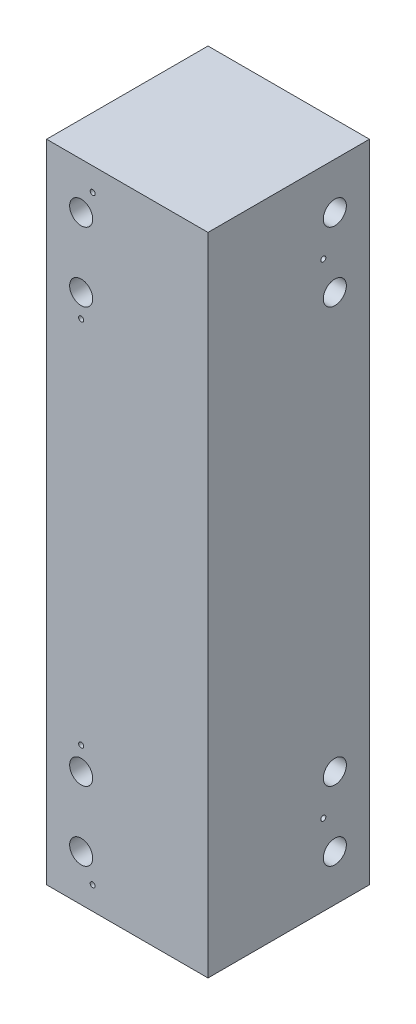
ISO-10303-21;
HEADER;
FILE_DESCRIPTION(('STEP AP214'),'2;1');
FILE_NAME('part.step','',(''),(''),'','','');
FILE_SCHEMA(('AUTOMOTIVE_DESIGN { 1 0 10303 214 1 1 1 1 }'));
ENDSEC;
DATA;
#1=APPLICATION_CONTEXT('core data for automotive mechanical design processes');
#2=APPLICATION_PROTOCOL_DEFINITION('international standard','automotive_design',2000,#1);
#3=PRODUCT_CONTEXT('',#1,'mechanical');
#4=PRODUCT('Part','Part','',(#3));
#5=PRODUCT_RELATED_PRODUCT_CATEGORY('part','',(#4));
#6=PRODUCT_DEFINITION_FORMATION('','',#4);
#7=PRODUCT_DEFINITION_CONTEXT('part definition',#1,'design');
#8=PRODUCT_DEFINITION('design','',#6,#7);
#9=PRODUCT_DEFINITION_SHAPE('','',#8);
#10=(LENGTH_UNIT() NAMED_UNIT(*) SI_UNIT(.MILLI.,.METRE.));
#11=(NAMED_UNIT(*) PLANE_ANGLE_UNIT() SI_UNIT($,.RADIAN.));
#12=(NAMED_UNIT(*) SI_UNIT($,.STERADIAN.) SOLID_ANGLE_UNIT());
#13=UNCERTAINTY_MEASURE_WITH_UNIT(LENGTH_MEASURE(1.E-05),#10,'distance_accuracy_value','');
#14=(GEOMETRIC_REPRESENTATION_CONTEXT(3) GLOBAL_UNCERTAINTY_ASSIGNED_CONTEXT((#13)) GLOBAL_UNIT_ASSIGNED_CONTEXT((#10,
#11,#12)) REPRESENTATION_CONTEXT('',''));
#15=CARTESIAN_POINT('',(0.,0.,0.));
#16=DIRECTION('',(0.,0.,1.));
#17=DIRECTION('',(1.,0.,0.));
#18=AXIS2_PLACEMENT_3D('',#15,#16,#17);
#19=CARTESIAN_POINT('',(0.,355.6,0.));
#20=DIRECTION('',(1.,0.,0.));
#21=DIRECTION('',(0.,0.,-1.));
#22=AXIS2_PLACEMENT_3D('',#19,#20,#21);
#23=PLANE('',#22);
#24=CARTESIAN_POINT('',(0.,311.15,25.4));
#25=DIRECTION('',(-1.,0.,0.));
#26=DIRECTION('',(0.,0.,1.));
#27=AXIS2_PLACEMENT_3D('',#24,#25,#26);
#28=CIRCLE('',#27,1.38906249999996);
#29=CARTESIAN_POINT('',(0.,311.15,26.7890625));
#30=VERTEX_POINT('',#29);
#31=EDGE_CURVE('E227',#30,#30,#28,.T.);
#32=ORIENTED_EDGE('',*,*,#31,.F.);
#33=EDGE_LOOP('',(#32));
#34=FACE_BOUND('',#33,.T.);
#35=CARTESIAN_POINT('',(0.,44.45,25.4));
#36=DIRECTION('',(-1.,0.,0.));
#37=DIRECTION('',(0.,0.,1.));
#38=AXIS2_PLACEMENT_3D('',#35,#36,#37);
#39=CIRCLE('',#38,1.3890625);
#40=CARTESIAN_POINT('',(0.,44.45,26.7890625));
#41=VERTEX_POINT('',#40);
#42=EDGE_CURVE('E231',#41,#41,#39,.T.);
#43=ORIENTED_EDGE('',*,*,#42,.F.);
#44=EDGE_LOOP('',(#43));
#45=FACE_BOUND('',#44,.T.);
#46=DIRECTION('',(0.,0.,1.));
#47=VECTOR('',#46,1.);
#48=CARTESIAN_POINT('',(0.,0.,0.));
#49=LINE('',#48,#47);
#50=CARTESIAN_POINT('',(0.,0.,0.));
#51=VERTEX_POINT('',#50);
#52=CARTESIAN_POINT('',(0.,0.,88.9));
#53=VERTEX_POINT('',#52);
#54=EDGE_CURVE('E298',#51,#53,#49,.T.);
#55=ORIENTED_EDGE('',*,*,#54,.T.);
#56=DIRECTION('',(0.,-1.,0.));
#57=VECTOR('',#56,1.);
#58=CARTESIAN_POINT('',(0.,355.6,88.9));
#59=LINE('',#58,#57);
#60=CARTESIAN_POINT('',(0.,355.6,88.9));
#61=VERTEX_POINT('',#60);
#62=EDGE_CURVE('E12',#61,#53,#59,.T.);
#63=ORIENTED_EDGE('',*,*,#62,.F.);
#64=DIRECTION('',(0.,0.,1.));
#65=VECTOR('',#64,1.);
#66=CARTESIAN_POINT('',(0.,355.6,0.));
#67=LINE('',#66,#65);
#68=CARTESIAN_POINT('',(0.,355.6,0.));
#69=VERTEX_POINT('',#68);
#70=EDGE_CURVE('E297',#69,#61,#67,.T.);
#71=ORIENTED_EDGE('',*,*,#70,.F.);
#72=DIRECTION('',(0.,-1.,0.));
#73=VECTOR('',#72,1.);
#74=CARTESIAN_POINT('',(0.,355.6,0.));
#75=LINE('',#74,#73);
#76=EDGE_CURVE('E282',#69,#51,#75,.T.);
#77=ORIENTED_EDGE('',*,*,#76,.T.);
#78=EDGE_LOOP('',(#55,#63,#71,#77));
#79=FACE_BOUND('',#78,.T.);
#80=ADVANCED_FACE('F56',(#34,#45,#79),#23,.F.);
#81=CARTESIAN_POINT('',(0.,355.6,88.9));
#82=DIRECTION('',(0.,0.,-1.));
#83=DIRECTION('',(-1.,0.,0.));
#84=AXIS2_PLACEMENT_3D('',#81,#82,#83);
#85=PLANE('',#84);
#86=CARTESIAN_POINT('',(19.05,292.1,88.9));
#87=DIRECTION('',(0.,0.,1.));
#88=DIRECTION('',(1.,0.,0.));
#89=AXIS2_PLACEMENT_3D('',#86,#87,#88);
#90=CIRCLE('',#89,6.34999999999999);
#91=CARTESIAN_POINT('',(25.4,292.1,88.9));
#92=VERTEX_POINT('',#91);
#93=EDGE_CURVE('E174',#92,#92,#90,.T.);
#94=ORIENTED_EDGE('',*,*,#93,.F.);
#95=EDGE_LOOP('',(#94));
#96=FACE_BOUND('',#95,.T.);
#97=CARTESIAN_POINT('',(19.05,330.2,88.9));
#98=DIRECTION('',(0.,0.,1.));
#99=DIRECTION('',(1.,0.,0.));
#100=AXIS2_PLACEMENT_3D('',#97,#98,#99);
#101=CIRCLE('',#100,6.34999999999999);
#102=CARTESIAN_POINT('',(25.4,330.2,88.9));
#103=VERTEX_POINT('',#102);
#104=EDGE_CURVE('E180',#103,#103,#101,.T.);
#105=ORIENTED_EDGE('',*,*,#104,.F.);
#106=EDGE_LOOP('',(#105));
#107=FACE_BOUND('',#106,.T.);
#108=CARTESIAN_POINT('',(19.05,25.4,88.9));
#109=DIRECTION('',(0.,0.,1.));
#110=DIRECTION('',(1.,0.,0.));
#111=AXIS2_PLACEMENT_3D('',#108,#109,#110);
#112=CIRCLE('',#111,6.34999999999999);
#113=CARTESIAN_POINT('',(25.4,25.4,88.9));
#114=VERTEX_POINT('',#113);
#115=EDGE_CURVE('E186',#114,#114,#112,.T.);
#116=ORIENTED_EDGE('',*,*,#115,.F.);
#117=EDGE_LOOP('',(#116));
#118=FACE_BOUND('',#117,.T.);
#119=CARTESIAN_POINT('',(19.05,63.5,88.9));
#120=DIRECTION('',(0.,0.,1.));
#121=DIRECTION('',(1.,0.,0.));
#122=AXIS2_PLACEMENT_3D('',#119,#120,#121);
#123=CIRCLE('',#122,6.34999999999999);
#124=CARTESIAN_POINT('',(25.4,63.5,88.9));
#125=VERTEX_POINT('',#124);
#126=EDGE_CURVE('E192',#125,#125,#123,.T.);
#127=ORIENTED_EDGE('',*,*,#126,.F.);
#128=EDGE_LOOP('',(#127));
#129=FACE_BOUND('',#128,.T.);
#130=CARTESIAN_POINT('',(25.4,12.7,88.9));
#131=DIRECTION('',(0.,0.,1.));
#132=DIRECTION('',(1.,0.,0.));
#133=AXIS2_PLACEMENT_3D('',#130,#131,#132);
#134=CIRCLE('',#133,1.3890625);
#135=CARTESIAN_POINT('',(26.7890625,12.7,88.9));
#136=VERTEX_POINT('',#135);
#137=EDGE_CURVE('E256',#136,#136,#134,.T.);
#138=ORIENTED_EDGE('',*,*,#137,.F.);
#139=EDGE_LOOP('',(#138));
#140=FACE_BOUND('',#139,.T.);
#141=CARTESIAN_POINT('',(19.05,76.2,88.9));
#142=DIRECTION('',(0.,0.,1.));
#143=DIRECTION('',(1.,0.,0.));
#144=AXIS2_PLACEMENT_3D('',#141,#142,#143);
#145=CIRCLE('',#144,1.38906250000001);
#146=CARTESIAN_POINT('',(20.4390625,76.2,88.9));
#147=VERTEX_POINT('',#146);
#148=EDGE_CURVE('E273',#147,#147,#145,.T.);
#149=ORIENTED_EDGE('',*,*,#148,.F.);
#150=EDGE_LOOP('',(#149));
#151=FACE_BOUND('',#150,.T.);
#152=CARTESIAN_POINT('',(25.4,342.9,88.9));
#153=DIRECTION('',(0.,0.,1.));
#154=DIRECTION('',(1.,0.,0.));
#155=AXIS2_PLACEMENT_3D('',#152,#153,#154);
#156=CIRCLE('',#155,1.38906249999996);
#157=CARTESIAN_POINT('',(26.7890625,342.9,88.9));
#158=VERTEX_POINT('',#157);
#159=EDGE_CURVE('E311',#158,#158,#156,.T.);
#160=ORIENTED_EDGE('',*,*,#159,.F.);
#161=EDGE_LOOP('',(#160));
#162=FACE_BOUND('',#161,.T.);
#163=CARTESIAN_POINT('',(19.05,279.4,88.9));
#164=DIRECTION('',(0.,0.,1.));
#165=DIRECTION('',(1.,0.,0.));
#166=AXIS2_PLACEMENT_3D('',#163,#164,#165);
#167=CIRCLE('',#166,1.38906249999998);
#168=CARTESIAN_POINT('',(20.4390625,279.4,88.9));
#169=VERTEX_POINT('',#168);
#170=EDGE_CURVE('E318',#169,#169,#167,.T.);
#171=ORIENTED_EDGE('',*,*,#170,.F.);
#172=EDGE_LOOP('',(#171));
#173=FACE_BOUND('',#172,.T.);
#174=DIRECTION('',(1.,0.,0.));
#175=VECTOR('',#174,1.);
#176=CARTESIAN_POINT('',(0.,0.,88.9));
#177=LINE('',#176,#175);
#178=CARTESIAN_POINT('',(88.9,0.,88.9));
#179=VERTEX_POINT('',#178);
#180=EDGE_CURVE('E296',#53,#179,#177,.T.);
#181=ORIENTED_EDGE('',*,*,#180,.T.);
#182=DIRECTION('',(0.,-1.,0.));
#183=VECTOR('',#182,1.);
#184=CARTESIAN_POINT('',(88.9,355.6,88.9));
#185=LINE('',#184,#183);
#186=CARTESIAN_POINT('',(88.9,355.6,88.9));
#187=VERTEX_POINT('',#186);
#188=EDGE_CURVE('E65',#187,#179,#185,.T.);
#189=ORIENTED_EDGE('',*,*,#188,.F.);
#190=DIRECTION('',(1.,0.,0.));
#191=VECTOR('',#190,1.);
#192=CARTESIAN_POINT('',(0.,355.6,88.9));
#193=LINE('',#192,#191);
#194=EDGE_CURVE('E104',#61,#187,#193,.T.);
#195=ORIENTED_EDGE('',*,*,#194,.F.);
#196=ORIENTED_EDGE('',*,*,#62,.T.);
#197=EDGE_LOOP('',(#181,#189,#195,#196));
#198=FACE_BOUND('',#197,.T.);
#199=ADVANCED_FACE('F329',(#96,#107,#118,#129,#140,#151,#162,#173,#198),#85,.F.);
#200=CARTESIAN_POINT('',(88.9,355.6,0.));
#201=DIRECTION('',(-1.,0.,0.));
#202=DIRECTION('',(0.,0.,1.));
#203=AXIS2_PLACEMENT_3D('',#200,#201,#202);
#204=PLANE('',#203);
#205=CARTESIAN_POINT('',(88.9,63.5,19.05));
#206=DIRECTION('',(1.,0.,0.));
#207=DIRECTION('',(0.,0.,-1.));
#208=AXIS2_PLACEMENT_3D('',#205,#206,#207);
#209=CIRCLE('',#208,6.34999999999999);
#210=CARTESIAN_POINT('',(88.9,63.5,12.7));
#211=VERTEX_POINT('',#210);
#212=EDGE_CURVE('E198',#211,#211,#209,.T.);
#213=ORIENTED_EDGE('',*,*,#212,.F.);
#214=EDGE_LOOP('',(#213));
#215=FACE_BOUND('',#214,.T.);
#216=CARTESIAN_POINT('',(88.9,25.4,19.05));
#217=DIRECTION('',(1.,0.,0.));
#218=DIRECTION('',(0.,0.,-1.));
#219=AXIS2_PLACEMENT_3D('',#216,#217,#218);
#220=CIRCLE('',#219,6.34999999999999);
#221=CARTESIAN_POINT('',(88.9,25.4,12.7));
#222=VERTEX_POINT('',#221);
#223=EDGE_CURVE('E204',#222,#222,#220,.T.);
#224=ORIENTED_EDGE('',*,*,#223,.F.);
#225=EDGE_LOOP('',(#224));
#226=FACE_BOUND('',#225,.T.);
#227=CARTESIAN_POINT('',(88.9,330.2,19.05));
#228=DIRECTION('',(1.,0.,0.));
#229=DIRECTION('',(0.,0.,-1.));
#230=AXIS2_PLACEMENT_3D('',#227,#228,#229);
#231=CIRCLE('',#230,6.34999999999997);
#232=CARTESIAN_POINT('',(88.9,330.2,12.7));
#233=VERTEX_POINT('',#232);
#234=EDGE_CURVE('E210',#233,#233,#231,.T.);
#235=ORIENTED_EDGE('',*,*,#234,.F.);
#236=EDGE_LOOP('',(#235));
#237=FACE_BOUND('',#236,.T.);
#238=CARTESIAN_POINT('',(88.9,292.1,19.05));
#239=DIRECTION('',(1.,0.,0.));
#240=DIRECTION('',(0.,0.,-1.));
#241=AXIS2_PLACEMENT_3D('',#238,#239,#240);
#242=CIRCLE('',#241,6.34999999999997);
#243=CARTESIAN_POINT('',(88.9,292.1,12.7));
#244=VERTEX_POINT('',#243);
#245=EDGE_CURVE('E216',#244,#244,#242,.T.);
#246=ORIENTED_EDGE('',*,*,#245,.F.);
#247=EDGE_LOOP('',(#246));
#248=FACE_BOUND('',#247,.T.);
#249=CARTESIAN_POINT('',(88.9,311.15,25.4));
#250=DIRECTION('',(-1.,0.,0.));
#251=DIRECTION('',(0.,0.,1.));
#252=AXIS2_PLACEMENT_3D('',#249,#250,#251);
#253=CIRCLE('',#252,1.38906249999996);
#254=CARTESIAN_POINT('',(88.9,311.15,26.7890625));
#255=VERTEX_POINT('',#254);
#256=EDGE_CURVE('E223',#255,#255,#253,.T.);
#257=ORIENTED_EDGE('',*,*,#256,.T.);
#258=EDGE_LOOP('',(#257));
#259=FACE_BOUND('',#258,.T.);
#260=CARTESIAN_POINT('',(88.9,44.45,25.4));
#261=DIRECTION('',(-1.,0.,0.));
#262=DIRECTION('',(0.,0.,1.));
#263=AXIS2_PLACEMENT_3D('',#260,#261,#262);
#264=CIRCLE('',#263,1.3890625);
#265=CARTESIAN_POINT('',(88.9,44.45,26.7890625));
#266=VERTEX_POINT('',#265);
#267=EDGE_CURVE('E222',#266,#266,#264,.T.);
#268=ORIENTED_EDGE('',*,*,#267,.T.);
#269=EDGE_LOOP('',(#268));
#270=FACE_BOUND('',#269,.T.);
#271=DIRECTION('',(0.,0.,-1.));
#272=VECTOR('',#271,1.);
#273=CARTESIAN_POINT('',(88.9,0.,0.));
#274=LINE('',#273,#272);
#275=CARTESIAN_POINT('',(88.9,0.,0.));
#276=VERTEX_POINT('',#275);
#277=EDGE_CURVE('E91',#179,#276,#274,.T.);
#278=ORIENTED_EDGE('',*,*,#277,.T.);
#279=DIRECTION('',(0.,-1.,0.));
#280=VECTOR('',#279,1.);
#281=CARTESIAN_POINT('',(88.9,355.6,0.));
#282=LINE('',#281,#280);
#283=CARTESIAN_POINT('',(88.9,355.6,0.));
#284=VERTEX_POINT('',#283);
#285=EDGE_CURVE('E286',#284,#276,#282,.T.);
#286=ORIENTED_EDGE('',*,*,#285,.F.);
#287=DIRECTION('',(0.,0.,-1.));
#288=VECTOR('',#287,1.);
#289=CARTESIAN_POINT('',(88.9,355.6,0.));
#290=LINE('',#289,#288);
#291=EDGE_CURVE('E292',#187,#284,#290,.T.);
#292=ORIENTED_EDGE('',*,*,#291,.F.);
#293=ORIENTED_EDGE('',*,*,#188,.T.);
#294=EDGE_LOOP('',(#278,#286,#292,#293));
#295=FACE_BOUND('',#294,.T.);
#296=ADVANCED_FACE('F291',(#215,#226,#237,#248,#259,#270,#295),#204,.F.);
#297=CARTESIAN_POINT('',(0.,355.6,0.));
#298=DIRECTION('',(0.,0.,1.));
#299=DIRECTION('',(1.,0.,0.));
#300=AXIS2_PLACEMENT_3D('',#297,#298,#299);
#301=PLANE('',#300);
#302=CARTESIAN_POINT('',(25.4,12.7,0.));
#303=DIRECTION('',(0.,0.,1.));
#304=DIRECTION('',(1.,0.,0.));
#305=AXIS2_PLACEMENT_3D('',#302,#303,#304);
#306=CIRCLE('',#305,1.3890625);
#307=CARTESIAN_POINT('',(26.7890625,12.7,0.));
#308=VERTEX_POINT('',#307);
#309=EDGE_CURVE('E226',#308,#308,#306,.T.);
#310=ORIENTED_EDGE('',*,*,#309,.T.);
#311=EDGE_LOOP('',(#310));
#312=FACE_BOUND('',#311,.T.);
#313=CARTESIAN_POINT('',(19.05,76.2,0.));
#314=DIRECTION('',(0.,0.,1.));
#315=DIRECTION('',(1.,0.,0.));
#316=AXIS2_PLACEMENT_3D('',#313,#314,#315);
#317=CIRCLE('',#316,1.38906250000001);
#318=CARTESIAN_POINT('',(20.4390625,76.2,0.));
#319=VERTEX_POINT('',#318);
#320=EDGE_CURVE('E269',#319,#319,#317,.T.);
#321=ORIENTED_EDGE('',*,*,#320,.T.);
#322=EDGE_LOOP('',(#321));
#323=FACE_BOUND('',#322,.T.);
#324=CARTESIAN_POINT('',(25.4,342.9,0.));
#325=DIRECTION('',(0.,0.,1.));
#326=DIRECTION('',(1.,0.,0.));
#327=AXIS2_PLACEMENT_3D('',#324,#325,#326);
#328=CIRCLE('',#327,1.38906249999996);
#329=CARTESIAN_POINT('',(26.7890625,342.9,0.));
#330=VERTEX_POINT('',#329);
#331=EDGE_CURVE('E307',#330,#330,#328,.T.);
#332=ORIENTED_EDGE('',*,*,#331,.T.);
#333=EDGE_LOOP('',(#332));
#334=FACE_BOUND('',#333,.T.);
#335=CARTESIAN_POINT('',(19.05,279.4,0.));
#336=DIRECTION('',(0.,0.,1.));
#337=DIRECTION('',(1.,0.,0.));
#338=AXIS2_PLACEMENT_3D('',#335,#336,#337);
#339=CIRCLE('',#338,1.38906249999998);
#340=CARTESIAN_POINT('',(20.4390625,279.4,0.));
#341=VERTEX_POINT('',#340);
#342=EDGE_CURVE('E257',#341,#341,#339,.T.);
#343=ORIENTED_EDGE('',*,*,#342,.T.);
#344=EDGE_LOOP('',(#343));
#345=FACE_BOUND('',#344,.T.);
#346=DIRECTION('',(-1.,0.,0.));
#347=VECTOR('',#346,1.);
#348=CARTESIAN_POINT('',(0.,0.,0.));
#349=LINE('',#348,#347);
#350=EDGE_CURVE('E97',#276,#51,#349,.T.);
#351=ORIENTED_EDGE('',*,*,#350,.T.);
#352=ORIENTED_EDGE('',*,*,#76,.F.);
#353=DIRECTION('',(-1.,0.,0.));
#354=VECTOR('',#353,1.);
#355=CARTESIAN_POINT('',(0.,355.6,0.));
#356=LINE('',#355,#354);
#357=EDGE_CURVE('E73',#284,#69,#356,.T.);
#358=ORIENTED_EDGE('',*,*,#357,.F.);
#359=ORIENTED_EDGE('',*,*,#285,.T.);
#360=EDGE_LOOP('',(#351,#352,#358,#359));
#361=FACE_BOUND('',#360,.T.);
#362=ADVANCED_FACE('F333',(#312,#323,#334,#345,#361),#301,.F.);
#363=CARTESIAN_POINT('',(0.,355.6,0.));
#364=DIRECTION('',(0.,1.,0.));
#365=DIRECTION('',(0.,0.,1.));
#366=AXIS2_PLACEMENT_3D('',#363,#364,#365);
#367=PLANE('',#366);
#368=ORIENTED_EDGE('',*,*,#70,.T.);
#369=ORIENTED_EDGE('',*,*,#194,.T.);
#370=ORIENTED_EDGE('',*,*,#291,.T.);
#371=ORIENTED_EDGE('',*,*,#357,.T.);
#372=EDGE_LOOP('',(#368,#369,#370,#371));
#373=FACE_BOUND('',#372,.T.);
#374=ADVANCED_FACE('F335',(#373),#367,.T.);
#375=CARTESIAN_POINT('',(0.,0.,0.));
#376=DIRECTION('',(0.,1.,0.));
#377=DIRECTION('',(0.,0.,1.));
#378=AXIS2_PLACEMENT_3D('',#375,#376,#377);
#379=PLANE('',#378);
#380=CARTESIAN_POINT('',(12.7,0.,63.5));
#381=DIRECTION('',(0.,-1.,0.));
#382=DIRECTION('',(0.,0.,-1.));
#383=AXIS2_PLACEMENT_3D('',#380,#381,#382);
#384=CIRCLE('',#383,2.45744999999999);
#385=CARTESIAN_POINT('',(12.7,0.,61.04255));
#386=VERTEX_POINT('',#385);
#387=EDGE_CURVE('E152',#386,#386,#384,.T.);
#388=ORIENTED_EDGE('',*,*,#387,.F.);
#389=EDGE_LOOP('',(#388));
#390=FACE_BOUND('',#389,.T.);
#391=CARTESIAN_POINT('',(63.5,0.,63.5));
#392=DIRECTION('',(0.,-1.,0.));
#393=DIRECTION('',(0.,0.,-1.));
#394=AXIS2_PLACEMENT_3D('',#391,#392,#393);
#395=CIRCLE('',#394,2.45744999999999);
#396=CARTESIAN_POINT('',(63.5,0.,61.04255));
#397=VERTEX_POINT('',#396);
#398=EDGE_CURVE('E151',#397,#397,#395,.T.);
#399=ORIENTED_EDGE('',*,*,#398,.F.);
#400=EDGE_LOOP('',(#399));
#401=FACE_BOUND('',#400,.T.);
#402=CARTESIAN_POINT('',(63.5,0.,12.7));
#403=DIRECTION('',(0.,-1.,0.));
#404=DIRECTION('',(0.,0.,-1.));
#405=AXIS2_PLACEMENT_3D('',#402,#403,#404);
#406=CIRCLE('',#405,2.45744999999999);
#407=CARTESIAN_POINT('',(63.5,0.,10.24255));
#408=VERTEX_POINT('',#407);
#409=EDGE_CURVE('E162',#408,#408,#406,.T.);
#410=ORIENTED_EDGE('',*,*,#409,.F.);
#411=EDGE_LOOP('',(#410));
#412=FACE_BOUND('',#411,.T.);
#413=CARTESIAN_POINT('',(12.7,0.,12.7));
#414=DIRECTION('',(0.,-1.,0.));
#415=DIRECTION('',(0.,0.,-1.));
#416=AXIS2_PLACEMENT_3D('',#413,#414,#415);
#417=CIRCLE('',#416,2.45744999999999);
#418=CARTESIAN_POINT('',(12.7,0.,10.24255));
#419=VERTEX_POINT('',#418);
#420=EDGE_CURVE('E168',#419,#419,#417,.T.);
#421=ORIENTED_EDGE('',*,*,#420,.F.);
#422=EDGE_LOOP('',(#421));
#423=FACE_BOUND('',#422,.T.);
#424=ORIENTED_EDGE('',*,*,#54,.F.);
#425=ORIENTED_EDGE('',*,*,#350,.F.);
#426=ORIENTED_EDGE('',*,*,#277,.F.);
#427=ORIENTED_EDGE('',*,*,#180,.F.);
#428=EDGE_LOOP('',(#424,#425,#426,#427));
#429=FACE_BOUND('',#428,.T.);
#430=ADVANCED_FACE('F295',(#390,#401,#412,#423,#429),#379,.F.);
#431=CARTESIAN_POINT('',(19.05,279.4,0.));
#432=DIRECTION('',(0.,0.,1.));
#433=DIRECTION('',(1.,0.,0.));
#434=AXIS2_PLACEMENT_3D('',#431,#432,#433);
#435=CYLINDRICAL_SURFACE('',#434,1.38906249999998);
#436=ORIENTED_EDGE('',*,*,#342,.F.);
#437=EDGE_LOOP('',(#436));
#438=FACE_BOUND('',#437,.T.);
#439=ORIENTED_EDGE('',*,*,#170,.T.);
#440=EDGE_LOOP('',(#439));
#441=FACE_BOUND('',#440,.T.);
#442=ADVANCED_FACE('F377',(#438,#441),#435,.F.);
#443=CARTESIAN_POINT('',(25.4,342.9,0.));
#444=DIRECTION('',(0.,0.,1.));
#445=DIRECTION('',(1.,0.,0.));
#446=AXIS2_PLACEMENT_3D('',#443,#444,#445);
#447=CYLINDRICAL_SURFACE('',#446,1.38906249999996);
#448=ORIENTED_EDGE('',*,*,#331,.F.);
#449=EDGE_LOOP('',(#448));
#450=FACE_BOUND('',#449,.T.);
#451=ORIENTED_EDGE('',*,*,#159,.T.);
#452=EDGE_LOOP('',(#451));
#453=FACE_BOUND('',#452,.T.);
#454=ADVANCED_FACE('F378',(#450,#453),#447,.F.);
#455=CARTESIAN_POINT('',(19.05,76.2,0.));
#456=DIRECTION('',(0.,0.,1.));
#457=DIRECTION('',(1.,0.,0.));
#458=AXIS2_PLACEMENT_3D('',#455,#456,#457);
#459=CYLINDRICAL_SURFACE('',#458,1.38906250000001);
#460=ORIENTED_EDGE('',*,*,#320,.F.);
#461=EDGE_LOOP('',(#460));
#462=FACE_BOUND('',#461,.T.);
#463=ORIENTED_EDGE('',*,*,#148,.T.);
#464=EDGE_LOOP('',(#463));
#465=FACE_BOUND('',#464,.T.);
#466=ADVANCED_FACE('F383',(#462,#465),#459,.F.);
#467=CARTESIAN_POINT('',(25.4,12.7,0.));
#468=DIRECTION('',(0.,0.,1.));
#469=DIRECTION('',(1.,0.,0.));
#470=AXIS2_PLACEMENT_3D('',#467,#468,#469);
#471=CYLINDRICAL_SURFACE('',#470,1.3890625);
#472=ORIENTED_EDGE('',*,*,#309,.F.);
#473=EDGE_LOOP('',(#472));
#474=FACE_BOUND('',#473,.T.);
#475=ORIENTED_EDGE('',*,*,#137,.T.);
#476=EDGE_LOOP('',(#475));
#477=FACE_BOUND('',#476,.T.);
#478=ADVANCED_FACE('F389',(#474,#477),#471,.F.);
#479=CARTESIAN_POINT('',(88.9,44.45,25.4));
#480=DIRECTION('',(-1.,0.,0.));
#481=DIRECTION('',(0.,0.,1.));
#482=AXIS2_PLACEMENT_3D('',#479,#480,#481);
#483=CYLINDRICAL_SURFACE('',#482,1.3890625);
#484=ORIENTED_EDGE('',*,*,#267,.F.);
#485=EDGE_LOOP('',(#484));
#486=FACE_BOUND('',#485,.T.);
#487=ORIENTED_EDGE('',*,*,#42,.T.);
#488=EDGE_LOOP('',(#487));
#489=FACE_BOUND('',#488,.T.);
#490=ADVANCED_FACE('F325',(#486,#489),#483,.F.);
#491=CARTESIAN_POINT('',(88.9,311.15,25.4));
#492=DIRECTION('',(-1.,0.,0.));
#493=DIRECTION('',(0.,0.,1.));
#494=AXIS2_PLACEMENT_3D('',#491,#492,#493);
#495=CYLINDRICAL_SURFACE('',#494,1.38906249999996);
#496=ORIENTED_EDGE('',*,*,#256,.F.);
#497=EDGE_LOOP('',(#496));
#498=FACE_BOUND('',#497,.T.);
#499=ORIENTED_EDGE('',*,*,#31,.T.);
#500=EDGE_LOOP('',(#499));
#501=FACE_BOUND('',#500,.T.);
#502=ADVANCED_FACE('F398',(#498,#501),#495,.F.);
#503=CARTESIAN_POINT('',(69.85,292.1,19.05));
#504=DIRECTION('',(1.,0.,0.));
#505=DIRECTION('',(0.,0.,-1.));
#506=AXIS2_PLACEMENT_3D('',#503,#504,#505);
#507=CONICAL_SURFACE('',#506,6.35000000000002,1.02974425867665);
#508=CARTESIAN_POINT('',(66.034535069175,292.1,19.05));
#509=VERTEX_POINT('',#508);
#510=VERTEX_LOOP('',#509);
#511=FACE_BOUND('',#510,.T.);
#512=CARTESIAN_POINT('',(69.85,292.1,19.05));
#513=DIRECTION('',(1.,0.,0.));
#514=DIRECTION('',(0.,0.,-1.));
#515=AXIS2_PLACEMENT_3D('',#512,#513,#514);
#516=CIRCLE('',#515,6.35000000000002);
#517=CARTESIAN_POINT('',(69.85,292.1,12.7));
#518=VERTEX_POINT('',#517);
#519=EDGE_CURVE('E219',#518,#518,#516,.T.);
#520=ORIENTED_EDGE('',*,*,#519,.T.);
#521=EDGE_LOOP('',(#520));
#522=FACE_BOUND('',#521,.T.);
#523=ADVANCED_FACE('F401',(#511,#522),#507,.F.);
#524=CARTESIAN_POINT('',(88.9,292.1,19.05));
#525=DIRECTION('',(1.,0.,0.));
#526=DIRECTION('',(0.,0.,-1.));
#527=AXIS2_PLACEMENT_3D('',#524,#525,#526);
#528=CYLINDRICAL_SURFACE('',#527,6.34999999999999);
#529=ORIENTED_EDGE('',*,*,#519,.F.);
#530=EDGE_LOOP('',(#529));
#531=FACE_BOUND('',#530,.T.);
#532=ORIENTED_EDGE('',*,*,#245,.T.);
#533=EDGE_LOOP('',(#532));
#534=FACE_BOUND('',#533,.T.);
#535=ADVANCED_FACE('F405',(#531,#534),#528,.F.);
#536=CARTESIAN_POINT('',(69.85,330.2,19.05));
#537=DIRECTION('',(1.,0.,0.));
#538=DIRECTION('',(0.,0.,-1.));
#539=AXIS2_PLACEMENT_3D('',#536,#537,#538);
#540=CONICAL_SURFACE('',#539,6.35000000000002,1.02974425867665);
#541=CARTESIAN_POINT('',(66.034535069175,330.2,19.05));
#542=VERTEX_POINT('',#541);
#543=VERTEX_LOOP('',#542);
#544=FACE_BOUND('',#543,.T.);
#545=CARTESIAN_POINT('',(69.85,330.2,19.05));
#546=DIRECTION('',(1.,0.,0.));
#547=DIRECTION('',(0.,0.,-1.));
#548=AXIS2_PLACEMENT_3D('',#545,#546,#547);
#549=CIRCLE('',#548,6.35000000000002);
#550=CARTESIAN_POINT('',(69.85,330.2,12.7));
#551=VERTEX_POINT('',#550);
#552=EDGE_CURVE('E213',#551,#551,#549,.T.);
#553=ORIENTED_EDGE('',*,*,#552,.T.);
#554=EDGE_LOOP('',(#553));
#555=FACE_BOUND('',#554,.T.);
#556=ADVANCED_FACE('F409',(#544,#555),#540,.F.);
#557=CARTESIAN_POINT('',(88.9,330.2,19.05));
#558=DIRECTION('',(1.,0.,0.));
#559=DIRECTION('',(0.,0.,-1.));
#560=AXIS2_PLACEMENT_3D('',#557,#558,#559);
#561=CYLINDRICAL_SURFACE('',#560,6.34999999999999);
#562=ORIENTED_EDGE('',*,*,#552,.F.);
#563=EDGE_LOOP('',(#562));
#564=FACE_BOUND('',#563,.T.);
#565=ORIENTED_EDGE('',*,*,#234,.T.);
#566=EDGE_LOOP('',(#565));
#567=FACE_BOUND('',#566,.T.);
#568=ADVANCED_FACE('F413',(#564,#567),#561,.F.);
#569=CARTESIAN_POINT('',(69.85,25.4,19.05));
#570=DIRECTION('',(1.,0.,0.));
#571=DIRECTION('',(0.,0.,-1.));
#572=AXIS2_PLACEMENT_3D('',#569,#570,#571);
#573=CONICAL_SURFACE('',#572,6.34999999999999,1.02974425867665);
#574=CARTESIAN_POINT('',(66.034535069175,25.4,19.05));
#575=VERTEX_POINT('',#574);
#576=VERTEX_LOOP('',#575);
#577=FACE_BOUND('',#576,.T.);
#578=CARTESIAN_POINT('',(69.85,25.4,19.05));
#579=DIRECTION('',(1.,0.,0.));
#580=DIRECTION('',(0.,0.,-1.));
#581=AXIS2_PLACEMENT_3D('',#578,#579,#580);
#582=CIRCLE('',#581,6.34999999999999);
#583=CARTESIAN_POINT('',(69.85,25.4,12.7));
#584=VERTEX_POINT('',#583);
#585=EDGE_CURVE('E207',#584,#584,#582,.T.);
#586=ORIENTED_EDGE('',*,*,#585,.T.);
#587=EDGE_LOOP('',(#586));
#588=FACE_BOUND('',#587,.T.);
#589=ADVANCED_FACE('F417',(#577,#588),#573,.F.);
#590=CARTESIAN_POINT('',(88.9,25.4,19.05));
#591=DIRECTION('',(1.,0.,0.));
#592=DIRECTION('',(0.,0.,-1.));
#593=AXIS2_PLACEMENT_3D('',#590,#591,#592);
#594=CYLINDRICAL_SURFACE('',#593,6.34999999999999);
#595=ORIENTED_EDGE('',*,*,#585,.F.);
#596=EDGE_LOOP('',(#595));
#597=FACE_BOUND('',#596,.T.);
#598=ORIENTED_EDGE('',*,*,#223,.T.);
#599=EDGE_LOOP('',(#598));
#600=FACE_BOUND('',#599,.T.);
#601=ADVANCED_FACE('F421',(#597,#600),#594,.F.);
#602=CARTESIAN_POINT('',(69.85,63.5,19.05));
#603=DIRECTION('',(1.,0.,0.));
#604=DIRECTION('',(0.,0.,-1.));
#605=AXIS2_PLACEMENT_3D('',#602,#603,#604);
#606=CONICAL_SURFACE('',#605,6.34999999999999,1.02974425867665);
#607=CARTESIAN_POINT('',(66.034535069175,63.5,19.05));
#608=VERTEX_POINT('',#607);
#609=VERTEX_LOOP('',#608);
#610=FACE_BOUND('',#609,.T.);
#611=CARTESIAN_POINT('',(69.85,63.5,19.05));
#612=DIRECTION('',(1.,0.,0.));
#613=DIRECTION('',(0.,0.,-1.));
#614=AXIS2_PLACEMENT_3D('',#611,#612,#613);
#615=CIRCLE('',#614,6.34999999999999);
#616=CARTESIAN_POINT('',(69.85,63.5,12.7));
#617=VERTEX_POINT('',#616);
#618=EDGE_CURVE('E201',#617,#617,#615,.T.);
#619=ORIENTED_EDGE('',*,*,#618,.T.);
#620=EDGE_LOOP('',(#619));
#621=FACE_BOUND('',#620,.T.);
#622=ADVANCED_FACE('F425',(#610,#621),#606,.F.);
#623=CARTESIAN_POINT('',(88.9,63.5,19.05));
#624=DIRECTION('',(1.,0.,0.));
#625=DIRECTION('',(0.,0.,-1.));
#626=AXIS2_PLACEMENT_3D('',#623,#624,#625);
#627=CYLINDRICAL_SURFACE('',#626,6.34999999999999);
#628=ORIENTED_EDGE('',*,*,#618,.F.);
#629=EDGE_LOOP('',(#628));
#630=FACE_BOUND('',#629,.T.);
#631=ORIENTED_EDGE('',*,*,#212,.T.);
#632=EDGE_LOOP('',(#631));
#633=FACE_BOUND('',#632,.T.);
#634=ADVANCED_FACE('F429',(#630,#633),#627,.F.);
#635=CARTESIAN_POINT('',(19.05,63.5,69.85));
#636=DIRECTION('',(0.,0.,1.));
#637=DIRECTION('',(1.,0.,0.));
#638=AXIS2_PLACEMENT_3D('',#635,#636,#637);
#639=CONICAL_SURFACE('',#638,6.34999999999999,1.02974425867665);
#640=CARTESIAN_POINT('',(19.05,63.5,66.034535069175));
#641=VERTEX_POINT('',#640);
#642=VERTEX_LOOP('',#641);
#643=FACE_BOUND('',#642,.T.);
#644=CARTESIAN_POINT('',(19.05,63.5,69.85));
#645=DIRECTION('',(0.,0.,1.));
#646=DIRECTION('',(1.,0.,0.));
#647=AXIS2_PLACEMENT_3D('',#644,#645,#646);
#648=CIRCLE('',#647,6.34999999999999);
#649=CARTESIAN_POINT('',(25.4,63.5,69.85));
#650=VERTEX_POINT('',#649);
#651=EDGE_CURVE('E195',#650,#650,#648,.T.);
#652=ORIENTED_EDGE('',*,*,#651,.T.);
#653=EDGE_LOOP('',(#652));
#654=FACE_BOUND('',#653,.T.);
#655=ADVANCED_FACE('F433',(#643,#654),#639,.F.);
#656=CARTESIAN_POINT('',(19.05,63.5,88.9));
#657=DIRECTION('',(0.,0.,1.));
#658=DIRECTION('',(1.,0.,0.));
#659=AXIS2_PLACEMENT_3D('',#656,#657,#658);
#660=CYLINDRICAL_SURFACE('',#659,6.34999999999999);
#661=ORIENTED_EDGE('',*,*,#651,.F.);
#662=EDGE_LOOP('',(#661));
#663=FACE_BOUND('',#662,.T.);
#664=ORIENTED_EDGE('',*,*,#126,.T.);
#665=EDGE_LOOP('',(#664));
#666=FACE_BOUND('',#665,.T.);
#667=ADVANCED_FACE('F437',(#663,#666),#660,.F.);
#668=CARTESIAN_POINT('',(19.05,25.4,69.85));
#669=DIRECTION('',(0.,0.,1.));
#670=DIRECTION('',(1.,0.,0.));
#671=AXIS2_PLACEMENT_3D('',#668,#669,#670);
#672=CONICAL_SURFACE('',#671,6.34999999999999,1.02974425867665);
#673=CARTESIAN_POINT('',(19.05,25.4,66.034535069175));
#674=VERTEX_POINT('',#673);
#675=VERTEX_LOOP('',#674);
#676=FACE_BOUND('',#675,.T.);
#677=CARTESIAN_POINT('',(19.05,25.4,69.85));
#678=DIRECTION('',(0.,0.,1.));
#679=DIRECTION('',(1.,0.,0.));
#680=AXIS2_PLACEMENT_3D('',#677,#678,#679);
#681=CIRCLE('',#680,6.34999999999999);
#682=CARTESIAN_POINT('',(25.4,25.4,69.85));
#683=VERTEX_POINT('',#682);
#684=EDGE_CURVE('E189',#683,#683,#681,.T.);
#685=ORIENTED_EDGE('',*,*,#684,.T.);
#686=EDGE_LOOP('',(#685));
#687=FACE_BOUND('',#686,.T.);
#688=ADVANCED_FACE('F441',(#676,#687),#672,.F.);
#689=CARTESIAN_POINT('',(19.05,25.4,88.9));
#690=DIRECTION('',(0.,0.,1.));
#691=DIRECTION('',(1.,0.,0.));
#692=AXIS2_PLACEMENT_3D('',#689,#690,#691);
#693=CYLINDRICAL_SURFACE('',#692,6.34999999999999);
#694=ORIENTED_EDGE('',*,*,#684,.F.);
#695=EDGE_LOOP('',(#694));
#696=FACE_BOUND('',#695,.T.);
#697=ORIENTED_EDGE('',*,*,#115,.T.);
#698=EDGE_LOOP('',(#697));
#699=FACE_BOUND('',#698,.T.);
#700=ADVANCED_FACE('F445',(#696,#699),#693,.F.);
#701=CARTESIAN_POINT('',(19.05,330.2,69.85));
#702=DIRECTION('',(0.,0.,1.));
#703=DIRECTION('',(1.,0.,0.));
#704=AXIS2_PLACEMENT_3D('',#701,#702,#703);
#705=CONICAL_SURFACE('',#704,6.34999999999999,1.02974425867665);
#706=CARTESIAN_POINT('',(19.05,330.2,66.034535069175));
#707=VERTEX_POINT('',#706);
#708=VERTEX_LOOP('',#707);
#709=FACE_BOUND('',#708,.T.);
#710=CARTESIAN_POINT('',(19.05,330.2,69.85));
#711=DIRECTION('',(0.,0.,1.));
#712=DIRECTION('',(1.,0.,0.));
#713=AXIS2_PLACEMENT_3D('',#710,#711,#712);
#714=CIRCLE('',#713,6.34999999999999);
#715=CARTESIAN_POINT('',(25.4,330.2,69.85));
#716=VERTEX_POINT('',#715);
#717=EDGE_CURVE('E183',#716,#716,#714,.T.);
#718=ORIENTED_EDGE('',*,*,#717,.T.);
#719=EDGE_LOOP('',(#718));
#720=FACE_BOUND('',#719,.T.);
#721=ADVANCED_FACE('F449',(#709,#720),#705,.F.);
#722=CARTESIAN_POINT('',(19.05,330.2,88.9));
#723=DIRECTION('',(0.,0.,1.));
#724=DIRECTION('',(1.,0.,0.));
#725=AXIS2_PLACEMENT_3D('',#722,#723,#724);
#726=CYLINDRICAL_SURFACE('',#725,6.34999999999999);
#727=ORIENTED_EDGE('',*,*,#717,.F.);
#728=EDGE_LOOP('',(#727));
#729=FACE_BOUND('',#728,.T.);
#730=ORIENTED_EDGE('',*,*,#104,.T.);
#731=EDGE_LOOP('',(#730));
#732=FACE_BOUND('',#731,.T.);
#733=ADVANCED_FACE('F453',(#729,#732),#726,.F.);
#734=CARTESIAN_POINT('',(19.05,292.1,69.85));
#735=DIRECTION('',(0.,0.,1.));
#736=DIRECTION('',(1.,0.,0.));
#737=AXIS2_PLACEMENT_3D('',#734,#735,#736);
#738=CONICAL_SURFACE('',#737,6.34999999999999,1.02974425867665);
#739=CARTESIAN_POINT('',(19.05,292.1,66.034535069175));
#740=VERTEX_POINT('',#739);
#741=VERTEX_LOOP('',#740);
#742=FACE_BOUND('',#741,.T.);
#743=CARTESIAN_POINT('',(19.05,292.1,69.85));
#744=DIRECTION('',(0.,0.,1.));
#745=DIRECTION('',(1.,0.,0.));
#746=AXIS2_PLACEMENT_3D('',#743,#744,#745);
#747=CIRCLE('',#746,6.34999999999999);
#748=CARTESIAN_POINT('',(25.4,292.1,69.85));
#749=VERTEX_POINT('',#748);
#750=EDGE_CURVE('E177',#749,#749,#747,.T.);
#751=ORIENTED_EDGE('',*,*,#750,.T.);
#752=EDGE_LOOP('',(#751));
#753=FACE_BOUND('',#752,.T.);
#754=ADVANCED_FACE('F457',(#742,#753),#738,.F.);
#755=CARTESIAN_POINT('',(19.05,292.1,88.9));
#756=DIRECTION('',(0.,0.,1.));
#757=DIRECTION('',(1.,0.,0.));
#758=AXIS2_PLACEMENT_3D('',#755,#756,#757);
#759=CYLINDRICAL_SURFACE('',#758,6.34999999999999);
#760=ORIENTED_EDGE('',*,*,#750,.F.);
#761=EDGE_LOOP('',(#760));
#762=FACE_BOUND('',#761,.T.);
#763=ORIENTED_EDGE('',*,*,#93,.T.);
#764=EDGE_LOOP('',(#763));
#765=FACE_BOUND('',#764,.T.);
#766=ADVANCED_FACE('F461',(#762,#765),#759,.F.);
#767=CARTESIAN_POINT('',(12.7,50.8,12.7));
#768=DIRECTION('',(0.,-1.,0.));
#769=DIRECTION('',(0.,0.,-1.));
#770=AXIS2_PLACEMENT_3D('',#767,#768,#769);
#771=CONICAL_SURFACE('',#770,2.45744999999998,1.02974425867665);
#772=CARTESIAN_POINT('',(12.7,52.2765849282293,12.7));
#773=VERTEX_POINT('',#772);
#774=VERTEX_LOOP('',#773);
#775=FACE_BOUND('',#774,.T.);
#776=CARTESIAN_POINT('',(12.7,50.8,12.7));
#777=DIRECTION('',(0.,-1.,0.));
#778=DIRECTION('',(0.,0.,-1.));
#779=AXIS2_PLACEMENT_3D('',#776,#777,#778);
#780=CIRCLE('',#779,2.45744999999998);
#781=CARTESIAN_POINT('',(12.7,50.8,10.24255));
#782=VERTEX_POINT('',#781);
#783=EDGE_CURVE('E171',#782,#782,#780,.T.);
#784=ORIENTED_EDGE('',*,*,#783,.T.);
#785=EDGE_LOOP('',(#784));
#786=FACE_BOUND('',#785,.T.);
#787=ADVANCED_FACE('F465',(#775,#786),#771,.F.);
#788=CARTESIAN_POINT('',(12.7,0.,12.7));
#789=DIRECTION('',(0.,-1.,0.));
#790=DIRECTION('',(0.,0.,-1.));
#791=AXIS2_PLACEMENT_3D('',#788,#789,#790);
#792=CYLINDRICAL_SURFACE('',#791,2.45744999999999);
#793=ORIENTED_EDGE('',*,*,#783,.F.);
#794=EDGE_LOOP('',(#793));
#795=FACE_BOUND('',#794,.T.);
#796=ORIENTED_EDGE('',*,*,#420,.T.);
#797=EDGE_LOOP('',(#796));
#798=FACE_BOUND('',#797,.T.);
#799=ADVANCED_FACE('F469',(#795,#798),#792,.F.);
#800=CARTESIAN_POINT('',(63.5,50.8,12.7));
#801=DIRECTION('',(0.,-1.,0.));
#802=DIRECTION('',(0.,0.,-1.));
#803=AXIS2_PLACEMENT_3D('',#800,#801,#802);
#804=CONICAL_SURFACE('',#803,2.45744999999999,1.02974425867665);
#805=CARTESIAN_POINT('',(63.5,52.2765849282293,12.7));
#806=VERTEX_POINT('',#805);
#807=VERTEX_LOOP('',#806);
#808=FACE_BOUND('',#807,.T.);
#809=CARTESIAN_POINT('',(63.5,50.8,12.7));
#810=DIRECTION('',(0.,-1.,0.));
#811=DIRECTION('',(0.,0.,-1.));
#812=AXIS2_PLACEMENT_3D('',#809,#810,#811);
#813=CIRCLE('',#812,2.45744999999999);
#814=CARTESIAN_POINT('',(63.5,50.8,10.24255));
#815=VERTEX_POINT('',#814);
#816=EDGE_CURVE('E165',#815,#815,#813,.T.);
#817=ORIENTED_EDGE('',*,*,#816,.T.);
#818=EDGE_LOOP('',(#817));
#819=FACE_BOUND('',#818,.T.);
#820=ADVANCED_FACE('F473',(#808,#819),#804,.F.);
#821=CARTESIAN_POINT('',(63.5,0.,12.7));
#822=DIRECTION('',(0.,-1.,0.));
#823=DIRECTION('',(0.,0.,-1.));
#824=AXIS2_PLACEMENT_3D('',#821,#822,#823);
#825=CYLINDRICAL_SURFACE('',#824,2.45744999999999);
#826=ORIENTED_EDGE('',*,*,#816,.F.);
#827=EDGE_LOOP('',(#826));
#828=FACE_BOUND('',#827,.T.);
#829=ORIENTED_EDGE('',*,*,#409,.T.);
#830=EDGE_LOOP('',(#829));
#831=FACE_BOUND('',#830,.T.);
#832=ADVANCED_FACE('F477',(#828,#831),#825,.F.);
#833=CARTESIAN_POINT('',(63.5,50.8,63.5));
#834=DIRECTION('',(0.,-1.,0.));
#835=DIRECTION('',(0.,0.,-1.));
#836=AXIS2_PLACEMENT_3D('',#833,#834,#835);
#837=CONICAL_SURFACE('',#836,2.45744999999999,1.02974425867665);
#838=CARTESIAN_POINT('',(63.5,52.2765849282293,63.5));
#839=VERTEX_POINT('',#838);
#840=VERTEX_LOOP('',#839);
#841=FACE_BOUND('',#840,.T.);
#842=CARTESIAN_POINT('',(63.5,50.8,63.5));
#843=DIRECTION('',(0.,-1.,0.));
#844=DIRECTION('',(0.,0.,-1.));
#845=AXIS2_PLACEMENT_3D('',#842,#843,#844);
#846=CIRCLE('',#845,2.45744999999999);
#847=CARTESIAN_POINT('',(63.5,50.8,61.04255));
#848=VERTEX_POINT('',#847);
#849=EDGE_CURVE('E155',#848,#848,#846,.T.);
#850=ORIENTED_EDGE('',*,*,#849,.T.);
#851=EDGE_LOOP('',(#850));
#852=FACE_BOUND('',#851,.T.);
#853=ADVANCED_FACE('F481',(#841,#852),#837,.F.);
#854=CARTESIAN_POINT('',(63.5,0.,63.5));
#855=DIRECTION('',(0.,-1.,0.));
#856=DIRECTION('',(0.,0.,-1.));
#857=AXIS2_PLACEMENT_3D('',#854,#855,#856);
#858=CYLINDRICAL_SURFACE('',#857,2.45744999999999);
#859=ORIENTED_EDGE('',*,*,#849,.F.);
#860=EDGE_LOOP('',(#859));
#861=FACE_BOUND('',#860,.T.);
#862=ORIENTED_EDGE('',*,*,#398,.T.);
#863=EDGE_LOOP('',(#862));
#864=FACE_BOUND('',#863,.T.);
#865=ADVANCED_FACE('F145',(#861,#864),#858,.F.);
#866=CARTESIAN_POINT('',(12.7,50.8,63.5));
#867=DIRECTION('',(0.,-1.,0.));
#868=DIRECTION('',(0.,0.,-1.));
#869=AXIS2_PLACEMENT_3D('',#866,#867,#868);
#870=CONICAL_SURFACE('',#869,2.45744999999998,1.02974425867665);
#871=CARTESIAN_POINT('',(12.7,52.2765849282293,63.5));
#872=VERTEX_POINT('',#871);
#873=VERTEX_LOOP('',#872);
#874=FACE_BOUND('',#873,.T.);
#875=CARTESIAN_POINT('',(12.7,50.8,63.5));
#876=DIRECTION('',(0.,-1.,0.));
#877=DIRECTION('',(0.,0.,-1.));
#878=AXIS2_PLACEMENT_3D('',#875,#876,#877);
#879=CIRCLE('',#878,2.45744999999998);
#880=CARTESIAN_POINT('',(12.7,50.8,61.04255));
#881=VERTEX_POINT('',#880);
#882=EDGE_CURVE('E149',#881,#881,#879,.T.);
#883=ORIENTED_EDGE('',*,*,#882,.T.);
#884=EDGE_LOOP('',(#883));
#885=FACE_BOUND('',#884,.T.);
#886=ADVANCED_FACE('F141',(#874,#885),#870,.F.);
#887=CARTESIAN_POINT('',(12.7,0.,63.5));
#888=DIRECTION('',(0.,-1.,0.));
#889=DIRECTION('',(0.,0.,-1.));
#890=AXIS2_PLACEMENT_3D('',#887,#888,#889);
#891=CYLINDRICAL_SURFACE('',#890,2.45744999999999);
#892=ORIENTED_EDGE('',*,*,#882,.F.);
#893=EDGE_LOOP('',(#892));
#894=FACE_BOUND('',#893,.T.);
#895=ORIENTED_EDGE('',*,*,#387,.T.);
#896=EDGE_LOOP('',(#895));
#897=FACE_BOUND('',#896,.T.);
#898=ADVANCED_FACE('F144',(#894,#897),#891,.F.);
#899=CLOSED_SHELL('',(#80,#199,#296,#362,#374,#430,#442,#454,#466,#478,#490,#502,#523,#535,#556,
#568,#589,#601,#622,#634,#655,#667,#688,#700,#721,#733,#754,#766,#787,#799,#820,#832,#853,#865,
#886,#898));
#900=MANIFOLD_SOLID_BREP('B2',#899);
#901=ADVANCED_BREP_SHAPE_REPRESENTATION('',(#18,#900),#14);
#902=SHAPE_DEFINITION_REPRESENTATION(#9,#901);
ENDSEC;
END-ISO-10303-21;
